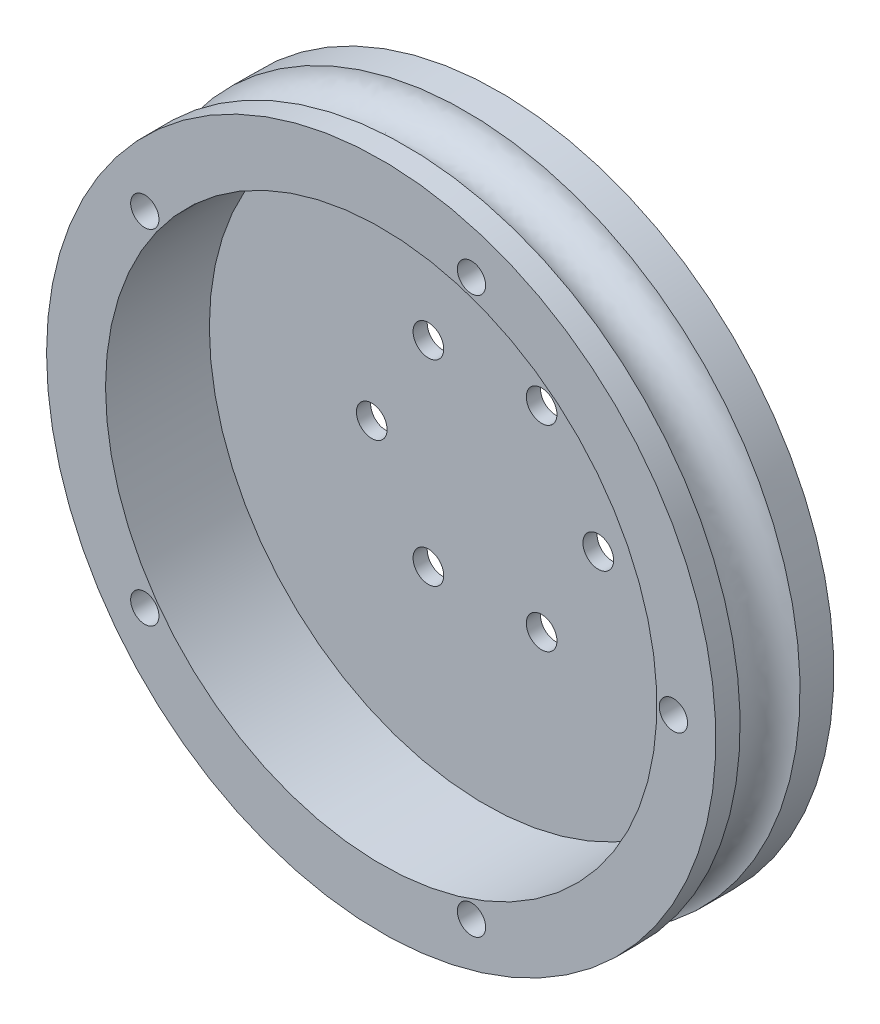
ISO-10303-21;
HEADER;
FILE_DESCRIPTION(('STEP AP214'),'2;1');
FILE_NAME('part.step','',(''),(''),'','','');
FILE_SCHEMA(('AUTOMOTIVE_DESIGN { 1 0 10303 214 1 1 1 1 }'));
ENDSEC;
DATA;
#1=APPLICATION_CONTEXT('core data for automotive mechanical design processes');
#2=APPLICATION_PROTOCOL_DEFINITION('international standard','automotive_design',2000,#1);
#3=PRODUCT_CONTEXT('',#1,'mechanical');
#4=PRODUCT('Part','Part','',(#3));
#5=PRODUCT_RELATED_PRODUCT_CATEGORY('part','',(#4));
#6=PRODUCT_DEFINITION_FORMATION('','',#4);
#7=PRODUCT_DEFINITION_CONTEXT('part definition',#1,'design');
#8=PRODUCT_DEFINITION('design','',#6,#7);
#9=PRODUCT_DEFINITION_SHAPE('','',#8);
#10=(LENGTH_UNIT() NAMED_UNIT(*) SI_UNIT(.MILLI.,.METRE.));
#11=(NAMED_UNIT(*) PLANE_ANGLE_UNIT() SI_UNIT($,.RADIAN.));
#12=(NAMED_UNIT(*) SI_UNIT($,.STERADIAN.) SOLID_ANGLE_UNIT());
#13=UNCERTAINTY_MEASURE_WITH_UNIT(LENGTH_MEASURE(1.E-05),#10,'distance_accuracy_value','');
#14=(GEOMETRIC_REPRESENTATION_CONTEXT(3) GLOBAL_UNCERTAINTY_ASSIGNED_CONTEXT((#13)) GLOBAL_UNIT_ASSIGNED_CONTEXT((#10,
#11,#12)) REPRESENTATION_CONTEXT('',''));
#15=CARTESIAN_POINT('',(0.,0.,0.));
#16=DIRECTION('',(0.,0.,1.));
#17=DIRECTION('',(1.,0.,0.));
#18=AXIS2_PLACEMENT_3D('',#15,#16,#17);
#19=CARTESIAN_POINT('',(11.2096637499569,57.3172158216385,74.6018381281178));
#20=DIRECTION('',(0.,0.,-1.));
#21=DIRECTION('',(-1.,0.,0.));
#22=AXIS2_PLACEMENT_3D('',#19,#20,#21);
#23=CYLINDRICAL_SURFACE('',#22,35.4663369894019);
#24=CARTESIAN_POINT('',(11.2096637499569,57.3172158216385,72.0273615546319));
#25=DIRECTION('',(0.,0.,-1.));
#26=DIRECTION('',(-1.,0.,0.));
#27=AXIS2_PLACEMENT_3D('',#24,#25,#26);
#28=CIRCLE('',#27,35.4663369894019);
#29=CARTESIAN_POINT('',(0.,90.965462403871,72.0273615546319));
#30=VERTEX_POINT('',#29);
#31=EDGE_CURVE('E14',#30,#30,#28,.T.);
#32=ORIENTED_EDGE('',*,*,#31,.F.);
#33=EDGE_LOOP('',(#32));
#34=FACE_BOUND('',#33,.T.);
#35=CARTESIAN_POINT('',(11.2096637499569,57.3172158216385,74.6018381281178));
#36=DIRECTION('',(0.,0.,-1.));
#37=DIRECTION('',(-1.,0.,0.));
#38=AXIS2_PLACEMENT_3D('',#35,#36,#37);
#39=CIRCLE('',#38,35.4663369894019);
#40=CARTESIAN_POINT('',(-24.256673239445,57.3172158216385,74.6018381281178));
#41=VERTEX_POINT('',#40);
#42=EDGE_CURVE('E141',#41,#41,#39,.T.);
#43=ORIENTED_EDGE('',*,*,#42,.T.);
#44=EDGE_LOOP('',(#43));
#45=FACE_BOUND('',#44,.T.);
#46=ADVANCED_FACE('F48',(#34,#45),#23,.T.);
#47=CARTESIAN_POINT('',(11.2096637499569,57.3172158216385,65.6763147016038));
#48=DIRECTION('',(0.,0.,-1.));
#49=DIRECTION('',(-1.,0.,0.));
#50=AXIS2_PLACEMENT_3D('',#47,#48,#49);
#51=CIRCLE('',#50,35.4663369894019);
#52=CARTESIAN_POINT('',(0.,90.965462403871,65.6763147016038));
#53=VERTEX_POINT('',#52);
#54=EDGE_CURVE('E56',#53,#53,#51,.F.);
#55=ORIENTED_EDGE('',*,*,#54,.F.);
#56=EDGE_LOOP('',(#55));
#57=FACE_BOUND('',#56,.T.);
#58=CARTESIAN_POINT('',(11.2096637499569,57.3172158216385,62.1018381281178));
#59=DIRECTION('',(0.,0.,-1.));
#60=DIRECTION('',(-1.,0.,0.));
#61=AXIS2_PLACEMENT_3D('',#58,#59,#60);
#62=CIRCLE('',#61,35.4663369894019);
#63=CARTESIAN_POINT('',(-24.256673239445,57.3172158216385,62.1018381281178));
#64=VERTEX_POINT('',#63);
#65=EDGE_CURVE('E140',#64,#64,#62,.T.);
#66=ORIENTED_EDGE('',*,*,#65,.F.);
#67=EDGE_LOOP('',(#66));
#68=FACE_BOUND('',#67,.T.);
#69=ADVANCED_FACE('F50',(#57,#68),#23,.T.);
#70=CARTESIAN_POINT('',(11.2096637499569,57.3172158216385,74.6018381281178));
#71=DIRECTION('',(0.,0.,-1.));
#72=DIRECTION('',(-1.,0.,0.));
#73=AXIS2_PLACEMENT_3D('',#70,#71,#72);
#74=PLANE('',#73);
#75=CARTESIAN_POINT('',(-13.8426291280109,75.5187720215277,74.6018381281178));
#76=DIRECTION('',(0.,0.,-1.));
#77=DIRECTION('',(0.809016994374951,-0.587785252292469,0.));
#78=AXIS2_PLACEMENT_3D('',#75,#76,#77);
#79=CIRCLE('',#78,1.5);
#80=CARTESIAN_POINT('',(-12.6291036364485,74.637094143089,74.6018381281178));
#81=VERTEX_POINT('',#80);
#82=EDGE_CURVE('E105',#81,#81,#79,.T.);
#83=ORIENTED_EDGE('',*,*,#82,.T.);
#84=EDGE_LOOP('',(#83));
#85=FACE_BOUND('',#84,.T.);
#86=CARTESIAN_POINT('',(-13.8426291280106,39.115659621749,74.6018381281178));
#87=DIRECTION('',(0.,0.,-1.));
#88=DIRECTION('',(0.809016994374942,0.58778525229248,0.));
#89=AXIS2_PLACEMENT_3D('',#86,#87,#88);
#90=CIRCLE('',#89,1.5);
#91=CARTESIAN_POINT('',(-12.6291036364482,39.9973375001877,74.6018381281178));
#92=VERTEX_POINT('',#91);
#93=EDGE_CURVE('E112',#92,#92,#90,.T.);
#94=ORIENTED_EDGE('',*,*,#93,.T.);
#95=EDGE_LOOP('',(#94));
#96=FACE_BOUND('',#95,.T.);
#97=CARTESIAN_POINT('',(20.778788133224,27.8664792420763,74.6018381281178));
#98=DIRECTION('',(0.,0.,-1.));
#99=DIRECTION('',(-0.309016994374958,0.95105651629515,0.));
#100=AXIS2_PLACEMENT_3D('',#97,#98,#99);
#101=CIRCLE('',#100,1.5);
#102=CARTESIAN_POINT('',(20.3152626416615,29.293064016519,74.6018381281178));
#103=VERTEX_POINT('',#102);
#104=EDGE_CURVE('E118',#103,#103,#101,.T.);
#105=ORIENTED_EDGE('',*,*,#104,.T.);
#106=EDGE_LOOP('',(#105));
#107=FACE_BOUND('',#106,.T.);
#108=CARTESIAN_POINT('',(20.7787881332235,86.7679524012009,74.6018381281178));
#109=DIRECTION('',(0.,0.,-1.));
#110=DIRECTION('',(-0.309016994374945,-0.951056516295155,0.));
#111=AXIS2_PLACEMENT_3D('',#108,#109,#110);
#112=CIRCLE('',#111,1.5);
#113=CARTESIAN_POINT('',(20.3152626416611,85.3413676267581,74.6018381281178));
#114=VERTEX_POINT('',#113);
#115=EDGE_CURVE('E123',#114,#114,#112,.T.);
#116=ORIENTED_EDGE('',*,*,#115,.T.);
#117=EDGE_LOOP('',(#116));
#118=FACE_BOUND('',#117,.T.);
#119=CARTESIAN_POINT('',(42.1760007393588,57.3172158216385,74.6018381281178));
#120=DIRECTION('',(0.,0.,-1.));
#121=DIRECTION('',(-1.,0.,0.));
#122=AXIS2_PLACEMENT_3D('',#119,#120,#121);
#123=CIRCLE('',#122,1.5);
#124=CARTESIAN_POINT('',(40.6760007393588,57.3172158216385,74.6018381281178));
#125=VERTEX_POINT('',#124);
#126=EDGE_CURVE('E129',#125,#125,#123,.T.);
#127=ORIENTED_EDGE('',*,*,#126,.T.);
#128=EDGE_LOOP('',(#127));
#129=FACE_BOUND('',#128,.T.);
#130=CARTESIAN_POINT('',(11.2096637499569,57.3172158216385,74.6018381281178));
#131=DIRECTION('',(0.,0.,-1.));
#132=DIRECTION('',(-1.,0.,0.));
#133=AXIS2_PLACEMENT_3D('',#130,#131,#132);
#134=CIRCLE('',#133,29.2163369894019);
#135=CARTESIAN_POINT('',(-18.006673239445,57.3172158216385,74.6018381281178));
#136=VERTEX_POINT('',#135);
#137=EDGE_CURVE('E132',#136,#136,#134,.T.);
#138=ORIENTED_EDGE('',*,*,#137,.T.);
#139=EDGE_LOOP('',(#138));
#140=FACE_BOUND('',#139,.T.);
#141=ORIENTED_EDGE('',*,*,#42,.F.);
#142=EDGE_LOOP('',(#141));
#143=FACE_BOUND('',#142,.T.);
#144=ADVANCED_FACE('F150',(#85,#96,#107,#118,#129,#140,#143),#74,.F.);
#145=CARTESIAN_POINT('',(11.2096637499569,57.3172158216385,62.1018381281178));
#146=DIRECTION('',(0.,0.,-1.));
#147=DIRECTION('',(-1.,0.,0.));
#148=AXIS2_PLACEMENT_3D('',#145,#146,#147);
#149=PLANE('',#148);
#150=CARTESIAN_POINT('',(17.2096637499569,46.9249109762253,62.1018381281178));
#151=DIRECTION('',(0.,0.,1.));
#152=DIRECTION('',(-0.500000000000004,0.866025403784436,0.));
#153=AXIS2_PLACEMENT_3D('',#150,#151,#152);
#154=CIRCLE('',#153,1.625);
#155=CARTESIAN_POINT('',(16.3971637499569,48.332202257375,62.1018381281178));
#156=VERTEX_POINT('',#155);
#157=EDGE_CURVE('E72',#156,#156,#154,.T.);
#158=ORIENTED_EDGE('',*,*,#157,.T.);
#159=EDGE_LOOP('',(#158));
#160=FACE_BOUND('',#159,.T.);
#161=CARTESIAN_POINT('',(23.2096637499569,57.3172158216385,62.1018381281178));
#162=DIRECTION('',(0.,0.,1.));
#163=DIRECTION('',(-1.,0.,0.));
#164=AXIS2_PLACEMENT_3D('',#161,#162,#163);
#165=CIRCLE('',#164,1.625);
#166=CARTESIAN_POINT('',(21.5846637499569,57.3172158216385,62.1018381281178));
#167=VERTEX_POINT('',#166);
#168=EDGE_CURVE('E79',#167,#167,#165,.T.);
#169=ORIENTED_EDGE('',*,*,#168,.T.);
#170=EDGE_LOOP('',(#169));
#171=FACE_BOUND('',#170,.T.);
#172=CARTESIAN_POINT('',(17.2096637499568,67.7095206670518,62.1018381281178));
#173=DIRECTION('',(0.,0.,1.));
#174=DIRECTION('',(-0.499999999999992,-0.866025403784443,0.));
#175=AXIS2_PLACEMENT_3D('',#172,#173,#174);
#176=CIRCLE('',#175,1.625);
#177=CARTESIAN_POINT('',(16.3971637499568,66.3022293859021,62.1018381281178));
#178=VERTEX_POINT('',#177);
#179=EDGE_CURVE('E85',#178,#178,#176,.T.);
#180=ORIENTED_EDGE('',*,*,#179,.T.);
#181=EDGE_LOOP('',(#180));
#182=FACE_BOUND('',#181,.T.);
#183=CARTESIAN_POINT('',(5.20966374995677,67.7095206670517,62.1018381281178));
#184=DIRECTION('',(0.,0.,1.));
#185=DIRECTION('',(0.50000000000001,-0.866025403784433,0.));
#186=AXIS2_PLACEMENT_3D('',#183,#184,#185);
#187=CIRCLE('',#186,1.625);
#188=CARTESIAN_POINT('',(6.02216374995678,66.302229385902,62.1018381281178));
#189=VERTEX_POINT('',#188);
#190=EDGE_CURVE('E69',#189,#189,#187,.T.);
#191=ORIENTED_EDGE('',*,*,#190,.T.);
#192=EDGE_LOOP('',(#191));
#193=FACE_BOUND('',#192,.T.);
#194=CARTESIAN_POINT('',(5.20966374995691,46.9249109762252,62.1018381281178));
#195=DIRECTION('',(0.,0.,1.));
#196=DIRECTION('',(0.499999999999998,0.86602540378444,0.));
#197=AXIS2_PLACEMENT_3D('',#194,#195,#196);
#198=CIRCLE('',#197,1.625);
#199=CARTESIAN_POINT('',(6.02216374995691,48.3322022573749,62.1018381281178));
#200=VERTEX_POINT('',#199);
#201=EDGE_CURVE('E93',#200,#200,#198,.T.);
#202=ORIENTED_EDGE('',*,*,#201,.T.);
#203=EDGE_LOOP('',(#202));
#204=FACE_BOUND('',#203,.T.);
#205=CARTESIAN_POINT('',(-0.790336250043112,57.3172158216385,62.1018381281178));
#206=DIRECTION('',(0.,0.,1.));
#207=DIRECTION('',(1.,0.,0.));
#208=AXIS2_PLACEMENT_3D('',#205,#206,#207);
#209=CIRCLE('',#208,1.625);
#210=CARTESIAN_POINT('',(0.834663749956889,57.3172158216385,62.1018381281178));
#211=VERTEX_POINT('',#210);
#212=EDGE_CURVE('E99',#211,#211,#209,.T.);
#213=ORIENTED_EDGE('',*,*,#212,.T.);
#214=EDGE_LOOP('',(#213));
#215=FACE_BOUND('',#214,.T.);
#216=CARTESIAN_POINT('',(-13.8426291280109,75.5187720215277,62.1018381281178));
#217=DIRECTION('',(0.,0.,-1.));
#218=DIRECTION('',(0.809016994374951,-0.587785252292469,0.));
#219=AXIS2_PLACEMENT_3D('',#216,#217,#218);
#220=CIRCLE('',#219,1.5);
#221=CARTESIAN_POINT('',(-12.6291036364485,74.637094143089,62.1018381281178));
#222=VERTEX_POINT('',#221);
#223=EDGE_CURVE('E109',#222,#222,#220,.T.);
#224=ORIENTED_EDGE('',*,*,#223,.F.);
#225=EDGE_LOOP('',(#224));
#226=FACE_BOUND('',#225,.T.);
#227=CARTESIAN_POINT('',(-13.8426291280106,39.115659621749,62.1018381281178));
#228=DIRECTION('',(0.,0.,-1.));
#229=DIRECTION('',(0.809016994374942,0.58778525229248,0.));
#230=AXIS2_PLACEMENT_3D('',#227,#228,#229);
#231=CIRCLE('',#230,1.5);
#232=CARTESIAN_POINT('',(-12.6291036364482,39.9973375001877,62.1018381281178));
#233=VERTEX_POINT('',#232);
#234=EDGE_CURVE('E115',#233,#233,#231,.T.);
#235=ORIENTED_EDGE('',*,*,#234,.F.);
#236=EDGE_LOOP('',(#235));
#237=FACE_BOUND('',#236,.T.);
#238=CARTESIAN_POINT('',(20.778788133224,27.8664792420763,62.1018381281178));
#239=DIRECTION('',(0.,0.,-1.));
#240=DIRECTION('',(-0.309016994374958,0.95105651629515,0.));
#241=AXIS2_PLACEMENT_3D('',#238,#239,#240);
#242=CIRCLE('',#241,1.5);
#243=CARTESIAN_POINT('',(20.3152626416615,29.293064016519,62.1018381281178));
#244=VERTEX_POINT('',#243);
#245=EDGE_CURVE('E102',#244,#244,#242,.T.);
#246=ORIENTED_EDGE('',*,*,#245,.F.);
#247=EDGE_LOOP('',(#246));
#248=FACE_BOUND('',#247,.T.);
#249=CARTESIAN_POINT('',(20.7787881332235,86.7679524012009,62.1018381281178));
#250=DIRECTION('',(0.,0.,-1.));
#251=DIRECTION('',(-0.309016994374945,-0.951056516295155,0.));
#252=AXIS2_PLACEMENT_3D('',#249,#250,#251);
#253=CIRCLE('',#252,1.5);
#254=CARTESIAN_POINT('',(20.3152626416611,85.3413676267581,62.1018381281178));
#255=VERTEX_POINT('',#254);
#256=EDGE_CURVE('E108',#255,#255,#253,.T.);
#257=ORIENTED_EDGE('',*,*,#256,.F.);
#258=EDGE_LOOP('',(#257));
#259=FACE_BOUND('',#258,.T.);
#260=CARTESIAN_POINT('',(42.1760007393588,57.3172158216385,62.1018381281178));
#261=DIRECTION('',(0.,0.,-1.));
#262=DIRECTION('',(-1.,0.,0.));
#263=AXIS2_PLACEMENT_3D('',#260,#261,#262);
#264=CIRCLE('',#263,1.5);
#265=CARTESIAN_POINT('',(40.6760007393588,57.3172158216385,62.1018381281178));
#266=VERTEX_POINT('',#265);
#267=EDGE_CURVE('E126',#266,#266,#264,.T.);
#268=ORIENTED_EDGE('',*,*,#267,.F.);
#269=EDGE_LOOP('',(#268));
#270=FACE_BOUND('',#269,.T.);
#271=ORIENTED_EDGE('',*,*,#65,.T.);
#272=EDGE_LOOP('',(#271));
#273=FACE_BOUND('',#272,.T.);
#274=ADVANCED_FACE('F147',(#160,#171,#182,#193,#204,#215,#226,#237,#248,#259,#270,#273),#149,.T.);
#275=CARTESIAN_POINT('',(11.2096637499569,57.3172158216385,-20.534441898432));
#276=DIRECTION('',(0.,0.,1.));
#277=DIRECTION('',(1.,0.,0.));
#278=AXIS2_PLACEMENT_3D('',#275,#276,#277);
#279=CYLINDRICAL_SURFACE('',#278,29.2163369894019);
#280=ORIENTED_EDGE('',*,*,#137,.F.);
#281=EDGE_LOOP('',(#280));
#282=FACE_BOUND('',#281,.T.);
#283=CARTESIAN_POINT('',(11.2096637499569,57.3172158216385,63.6018381281178));
#284=DIRECTION('',(0.,0.,-1.));
#285=DIRECTION('',(-1.,0.,0.));
#286=AXIS2_PLACEMENT_3D('',#283,#284,#285);
#287=CIRCLE('',#286,29.2163369894019);
#288=CARTESIAN_POINT('',(-18.006673239445,57.3172158216385,63.6018381281178));
#289=VERTEX_POINT('',#288);
#290=EDGE_CURVE('E137',#289,#289,#287,.T.);
#291=ORIENTED_EDGE('',*,*,#290,.T.);
#292=EDGE_LOOP('',(#291));
#293=FACE_BOUND('',#292,.T.);
#294=ADVANCED_FACE('F277',(#282,#293),#279,.F.);
#295=CARTESIAN_POINT('',(11.2096637499569,57.3172158216385,63.6018381281178));
#296=DIRECTION('',(0.,0.,-1.));
#297=DIRECTION('',(-1.,0.,0.));
#298=AXIS2_PLACEMENT_3D('',#295,#296,#297);
#299=PLANE('',#298);
#300=CARTESIAN_POINT('',(17.2096637499569,46.9249109762253,63.6018381281178));
#301=DIRECTION('',(0.,0.,1.));
#302=DIRECTION('',(-0.500000000000004,0.866025403784436,0.));
#303=AXIS2_PLACEMENT_3D('',#300,#301,#302);
#304=CIRCLE('',#303,1.625);
#305=CARTESIAN_POINT('',(16.3971637499569,48.332202257375,63.6018381281178));
#306=VERTEX_POINT('',#305);
#307=EDGE_CURVE('E76',#306,#306,#304,.T.);
#308=ORIENTED_EDGE('',*,*,#307,.F.);
#309=EDGE_LOOP('',(#308));
#310=FACE_BOUND('',#309,.T.);
#311=CARTESIAN_POINT('',(23.2096637499569,57.3172158216385,63.6018381281178));
#312=DIRECTION('',(0.,0.,1.));
#313=DIRECTION('',(-1.,0.,0.));
#314=AXIS2_PLACEMENT_3D('',#311,#312,#313);
#315=CIRCLE('',#314,1.625);
#316=CARTESIAN_POINT('',(21.5846637499569,57.3172158216385,63.6018381281178));
#317=VERTEX_POINT('',#316);
#318=EDGE_CURVE('E82',#317,#317,#315,.T.);
#319=ORIENTED_EDGE('',*,*,#318,.F.);
#320=EDGE_LOOP('',(#319));
#321=FACE_BOUND('',#320,.T.);
#322=CARTESIAN_POINT('',(17.2096637499568,67.7095206670518,63.6018381281178));
#323=DIRECTION('',(0.,0.,1.));
#324=DIRECTION('',(-0.499999999999992,-0.866025403784443,0.));
#325=AXIS2_PLACEMENT_3D('',#322,#323,#324);
#326=CIRCLE('',#325,1.625);
#327=CARTESIAN_POINT('',(16.3971637499568,66.3022293859021,63.6018381281178));
#328=VERTEX_POINT('',#327);
#329=EDGE_CURVE('E88',#328,#328,#326,.T.);
#330=ORIENTED_EDGE('',*,*,#329,.F.);
#331=EDGE_LOOP('',(#330));
#332=FACE_BOUND('',#331,.T.);
#333=CARTESIAN_POINT('',(5.20966374995677,67.7095206670517,63.6018381281178));
#334=DIRECTION('',(0.,0.,1.));
#335=DIRECTION('',(0.50000000000001,-0.866025403784433,0.));
#336=AXIS2_PLACEMENT_3D('',#333,#334,#335);
#337=CIRCLE('',#336,1.625);
#338=CARTESIAN_POINT('',(6.02216374995678,66.302229385902,63.6018381281178));
#339=VERTEX_POINT('',#338);
#340=EDGE_CURVE('E66',#339,#339,#337,.T.);
#341=ORIENTED_EDGE('',*,*,#340,.F.);
#342=EDGE_LOOP('',(#341));
#343=FACE_BOUND('',#342,.T.);
#344=CARTESIAN_POINT('',(5.20966374995691,46.9249109762252,63.6018381281178));
#345=DIRECTION('',(0.,0.,1.));
#346=DIRECTION('',(0.499999999999998,0.86602540378444,0.));
#347=AXIS2_PLACEMENT_3D('',#344,#345,#346);
#348=CIRCLE('',#347,1.625);
#349=CARTESIAN_POINT('',(6.02216374995691,48.3322022573749,63.6018381281178));
#350=VERTEX_POINT('',#349);
#351=EDGE_CURVE('E75',#350,#350,#348,.T.);
#352=ORIENTED_EDGE('',*,*,#351,.F.);
#353=EDGE_LOOP('',(#352));
#354=FACE_BOUND('',#353,.T.);
#355=CARTESIAN_POINT('',(-0.790336250043112,57.3172158216385,63.6018381281178));
#356=DIRECTION('',(0.,0.,1.));
#357=DIRECTION('',(1.,0.,0.));
#358=AXIS2_PLACEMENT_3D('',#355,#356,#357);
#359=CIRCLE('',#358,1.625);
#360=CARTESIAN_POINT('',(0.834663749956889,57.3172158216385,63.6018381281178));
#361=VERTEX_POINT('',#360);
#362=EDGE_CURVE('E96',#361,#361,#359,.T.);
#363=ORIENTED_EDGE('',*,*,#362,.F.);
#364=EDGE_LOOP('',(#363));
#365=FACE_BOUND('',#364,.T.);
#366=ORIENTED_EDGE('',*,*,#290,.F.);
#367=EDGE_LOOP('',(#366));
#368=FACE_BOUND('',#367,.T.);
#369=ADVANCED_FACE('F269',(#310,#321,#332,#343,#354,#365,#368),#299,.F.);
#370=CARTESIAN_POINT('',(42.1760007393588,57.3172158216385,74.6018381281178));
#371=DIRECTION('',(0.,0.,-1.));
#372=DIRECTION('',(-1.,0.,0.));
#373=AXIS2_PLACEMENT_3D('',#370,#371,#372);
#374=CYLINDRICAL_SURFACE('',#373,1.5);
#375=ORIENTED_EDGE('',*,*,#126,.F.);
#376=EDGE_LOOP('',(#375));
#377=FACE_BOUND('',#376,.T.);
#378=ORIENTED_EDGE('',*,*,#267,.T.);
#379=EDGE_LOOP('',(#378));
#380=FACE_BOUND('',#379,.T.);
#381=ADVANCED_FACE('F260',(#377,#380),#374,.F.);
#382=CARTESIAN_POINT('',(20.7787881332235,86.7679524012009,74.6018381281178));
#383=DIRECTION('',(0.,0.,-1.));
#384=DIRECTION('',(-1.,0.,0.));
#385=AXIS2_PLACEMENT_3D('',#382,#383,#384);
#386=CYLINDRICAL_SURFACE('',#385,1.5);
#387=ORIENTED_EDGE('',*,*,#115,.F.);
#388=EDGE_LOOP('',(#387));
#389=FACE_BOUND('',#388,.T.);
#390=ORIENTED_EDGE('',*,*,#256,.T.);
#391=EDGE_LOOP('',(#390));
#392=FACE_BOUND('',#391,.T.);
#393=ADVANCED_FACE('F252',(#389,#392),#386,.F.);
#394=CARTESIAN_POINT('',(20.778788133224,27.8664792420763,74.6018381281178));
#395=DIRECTION('',(0.,0.,-1.));
#396=DIRECTION('',(-1.,0.,0.));
#397=AXIS2_PLACEMENT_3D('',#394,#395,#396);
#398=CYLINDRICAL_SURFACE('',#397,1.5);
#399=ORIENTED_EDGE('',*,*,#104,.F.);
#400=EDGE_LOOP('',(#399));
#401=FACE_BOUND('',#400,.T.);
#402=ORIENTED_EDGE('',*,*,#245,.T.);
#403=EDGE_LOOP('',(#402));
#404=FACE_BOUND('',#403,.T.);
#405=ADVANCED_FACE('F244',(#401,#404),#398,.F.);
#406=CARTESIAN_POINT('',(-13.8426291280106,39.115659621749,74.6018381281178));
#407=DIRECTION('',(0.,0.,-1.));
#408=DIRECTION('',(-1.,0.,0.));
#409=AXIS2_PLACEMENT_3D('',#406,#407,#408);
#410=CYLINDRICAL_SURFACE('',#409,1.5);
#411=ORIENTED_EDGE('',*,*,#93,.F.);
#412=EDGE_LOOP('',(#411));
#413=FACE_BOUND('',#412,.T.);
#414=ORIENTED_EDGE('',*,*,#234,.T.);
#415=EDGE_LOOP('',(#414));
#416=FACE_BOUND('',#415,.T.);
#417=ADVANCED_FACE('F236',(#413,#416),#410,.F.);
#418=CARTESIAN_POINT('',(-13.8426291280109,75.5187720215277,74.6018381281178));
#419=DIRECTION('',(0.,0.,-1.));
#420=DIRECTION('',(-1.,0.,0.));
#421=AXIS2_PLACEMENT_3D('',#418,#419,#420);
#422=CYLINDRICAL_SURFACE('',#421,1.5);
#423=ORIENTED_EDGE('',*,*,#82,.F.);
#424=EDGE_LOOP('',(#423));
#425=FACE_BOUND('',#424,.T.);
#426=ORIENTED_EDGE('',*,*,#223,.T.);
#427=EDGE_LOOP('',(#426));
#428=FACE_BOUND('',#427,.T.);
#429=ADVANCED_FACE('F227',(#425,#428),#422,.F.);
#430=CARTESIAN_POINT('',(-0.790336250043112,57.3172158216385,62.1018381281178));
#431=DIRECTION('',(0.,0.,1.));
#432=DIRECTION('',(1.,0.,0.));
#433=AXIS2_PLACEMENT_3D('',#430,#431,#432);
#434=CYLINDRICAL_SURFACE('',#433,1.625);
#435=ORIENTED_EDGE('',*,*,#212,.F.);
#436=EDGE_LOOP('',(#435));
#437=FACE_BOUND('',#436,.T.);
#438=ORIENTED_EDGE('',*,*,#362,.T.);
#439=EDGE_LOOP('',(#438));
#440=FACE_BOUND('',#439,.T.);
#441=ADVANCED_FACE('F218',(#437,#440),#434,.F.);
#442=CARTESIAN_POINT('',(5.20966374995691,46.9249109762252,62.1018381281178));
#443=DIRECTION('',(0.,0.,1.));
#444=DIRECTION('',(1.,0.,0.));
#445=AXIS2_PLACEMENT_3D('',#442,#443,#444);
#446=CYLINDRICAL_SURFACE('',#445,1.625);
#447=ORIENTED_EDGE('',*,*,#201,.F.);
#448=EDGE_LOOP('',(#447));
#449=FACE_BOUND('',#448,.T.);
#450=ORIENTED_EDGE('',*,*,#351,.T.);
#451=EDGE_LOOP('',(#450));
#452=FACE_BOUND('',#451,.T.);
#453=ADVANCED_FACE('F210',(#449,#452),#446,.F.);
#454=CARTESIAN_POINT('',(5.20966374995677,67.7095206670517,62.1018381281178));
#455=DIRECTION('',(0.,0.,1.));
#456=DIRECTION('',(1.,0.,0.));
#457=AXIS2_PLACEMENT_3D('',#454,#455,#456);
#458=CYLINDRICAL_SURFACE('',#457,1.625);
#459=ORIENTED_EDGE('',*,*,#190,.F.);
#460=EDGE_LOOP('',(#459));
#461=FACE_BOUND('',#460,.T.);
#462=ORIENTED_EDGE('',*,*,#340,.T.);
#463=EDGE_LOOP('',(#462));
#464=FACE_BOUND('',#463,.T.);
#465=ADVANCED_FACE('F202',(#461,#464),#458,.F.);
#466=CARTESIAN_POINT('',(17.2096637499568,67.7095206670518,62.1018381281178));
#467=DIRECTION('',(0.,0.,1.));
#468=DIRECTION('',(1.,0.,0.));
#469=AXIS2_PLACEMENT_3D('',#466,#467,#468);
#470=CYLINDRICAL_SURFACE('',#469,1.625);
#471=ORIENTED_EDGE('',*,*,#179,.F.);
#472=EDGE_LOOP('',(#471));
#473=FACE_BOUND('',#472,.T.);
#474=ORIENTED_EDGE('',*,*,#329,.T.);
#475=EDGE_LOOP('',(#474));
#476=FACE_BOUND('',#475,.T.);
#477=ADVANCED_FACE('F194',(#473,#476),#470,.F.);
#478=CARTESIAN_POINT('',(23.2096637499569,57.3172158216385,62.1018381281178));
#479=DIRECTION('',(0.,0.,1.));
#480=DIRECTION('',(1.,0.,0.));
#481=AXIS2_PLACEMENT_3D('',#478,#479,#480);
#482=CYLINDRICAL_SURFACE('',#481,1.625);
#483=ORIENTED_EDGE('',*,*,#168,.F.);
#484=EDGE_LOOP('',(#483));
#485=FACE_BOUND('',#484,.T.);
#486=ORIENTED_EDGE('',*,*,#318,.T.);
#487=EDGE_LOOP('',(#486));
#488=FACE_BOUND('',#487,.T.);
#489=ADVANCED_FACE('F189',(#485,#488),#482,.F.);
#490=CARTESIAN_POINT('',(17.2096637499569,46.9249109762253,62.1018381281178));
#491=DIRECTION('',(0.,0.,1.));
#492=DIRECTION('',(1.,0.,0.));
#493=AXIS2_PLACEMENT_3D('',#490,#491,#492);
#494=CYLINDRICAL_SURFACE('',#493,1.625);
#495=ORIENTED_EDGE('',*,*,#157,.F.);
#496=EDGE_LOOP('',(#495));
#497=FACE_BOUND('',#496,.T.);
#498=ORIENTED_EDGE('',*,*,#307,.T.);
#499=EDGE_LOOP('',(#498));
#500=FACE_BOUND('',#499,.T.);
#501=ADVANCED_FACE('F171',(#497,#500),#494,.F.);
#502=CARTESIAN_POINT('',(0.,91.36049527296,65.6518381281178));
#503=CARTESIAN_POINT('',(68.0865589026431,113.779822772874,65.6518381281178));
#504=CARTESIAN_POINT('',(90.5058864025569,45.6932638702307,65.6518381281178));
#505=CARTESIAN_POINT('',(22.4193274999138,23.273936370317,65.6518381281178));
#506=CARTESIAN_POINT('',(-45.6672314027293,0.854608870403187,65.6518381281178));
#507=CARTESIAN_POINT('',(-68.0865589026431,68.9411677730463,65.6518381281178));
#508=CARTESIAN_POINT('',(0.,91.36049527296,65.6518381281178));
#509=CARTESIAN_POINT('',(0.,97.7604952729601,65.6518381281178));
#510=CARTESIAN_POINT('',(80.8865589026431,120.179822772874,65.6518381281178));
#511=CARTESIAN_POINT('',(103.305886402557,39.2932638702307,65.6518381281178));
#512=CARTESIAN_POINT('',(22.4193274999138,16.8739363703169,65.6518381281178));
#513=CARTESIAN_POINT('',(-58.4672314027294,-5.54539112959684,65.6518381281178));
#514=CARTESIAN_POINT('',(-80.8865589026431,75.3411677730463,65.6518381281178));
#515=CARTESIAN_POINT('',(0.,97.7604952729601,65.6518381281178));
#516=CARTESIAN_POINT('',(0.,97.7604952729601,72.0518381281179));
#517=CARTESIAN_POINT('',(80.8865589026431,120.179822772874,72.0518381281179));
#518=CARTESIAN_POINT('',(103.305886402557,39.2932638702307,72.0518381281179));
#519=CARTESIAN_POINT('',(22.4193274999138,16.8739363703169,72.0518381281179));
#520=CARTESIAN_POINT('',(-58.4672314027294,-5.54539112959684,72.0518381281179));
#521=CARTESIAN_POINT('',(-80.8865589026431,75.3411677730463,72.0518381281179));
#522=CARTESIAN_POINT('',(0.,97.7604952729601,72.0518381281179));
#523=CARTESIAN_POINT('',(0.,91.36049527296,72.0518381281179));
#524=CARTESIAN_POINT('',(68.0865589026431,113.779822772874,72.0518381281179));
#525=CARTESIAN_POINT('',(90.5058864025569,45.6932638702307,72.0518381281179));
#526=CARTESIAN_POINT('',(22.4193274999138,23.273936370317,72.0518381281179));
#527=CARTESIAN_POINT('',(-45.6672314027293,0.854608870403187,72.0518381281179));
#528=CARTESIAN_POINT('',(-68.0865589026431,68.9411677730463,72.0518381281179));
#529=CARTESIAN_POINT('',(0.,91.36049527296,72.0518381281179));
#530=CARTESIAN_POINT('',(0.,84.96049527296,72.0518381281179));
#531=CARTESIAN_POINT('',(55.286558902643,107.379822772874,72.0518381281179));
#532=CARTESIAN_POINT('',(77.7058864025568,52.0932638702308,72.0518381281179));
#533=CARTESIAN_POINT('',(22.4193274999138,29.673936370317,72.0518381281179));
#534=CARTESIAN_POINT('',(-32.8672314027292,7.25460887040322,72.0518381281179));
#535=CARTESIAN_POINT('',(-55.286558902643,62.5411677730462,72.0518381281179));
#536=CARTESIAN_POINT('',(0.,84.96049527296,72.0518381281179));
#537=CARTESIAN_POINT('',(0.,84.96049527296,65.6518381281178));
#538=CARTESIAN_POINT('',(55.286558902643,107.379822772874,65.6518381281178));
#539=CARTESIAN_POINT('',(77.7058864025568,52.0932638702308,65.6518381281178));
#540=CARTESIAN_POINT('',(22.4193274999138,29.673936370317,65.6518381281178));
#541=CARTESIAN_POINT('',(-32.8672314027292,7.25460887040322,65.6518381281178));
#542=CARTESIAN_POINT('',(-55.286558902643,62.5411677730462,65.6518381281178));
#543=CARTESIAN_POINT('',(0.,84.96049527296,65.6518381281178));
#544=CARTESIAN_POINT('',(0.,91.36049527296,65.6518381281178));
#545=CARTESIAN_POINT('',(68.0865589026431,113.779822772874,65.6518381281178));
#546=CARTESIAN_POINT('',(90.5058864025569,45.6932638702307,65.6518381281178));
#547=CARTESIAN_POINT('',(22.4193274999138,23.273936370317,65.6518381281178));
#548=CARTESIAN_POINT('',(-45.6672314027293,0.854608870403187,65.6518381281178));
#549=CARTESIAN_POINT('',(-68.0865589026431,68.9411677730463,65.6518381281178));
#550=CARTESIAN_POINT('',(0.,91.36049527296,65.6518381281178));
#551=(BOUNDED_SURFACE() B_SPLINE_SURFACE(3,3,((#502,#503,#504,#505,#506,#507,#508),(#509,#510,
#511,#512,#513,#514,#515),(#516,#517,#518,#519,#520,#521,#522),(#523,#524,#525,#526,#527,#528,
#529),(#530,#531,#532,#533,#534,#535,#536),(#537,#538,#539,#540,#541,#542,#543),(#544,#545,#546,
#547,#548,#549,#550)),.UNSPECIFIED.,.T.,.T.,.F.) B_SPLINE_SURFACE_WITH_KNOTS((4,3,4),(4,3,4),
(0.,0.5,1.),(0.,0.5,1.),
.UNSPECIFIED.) GEOMETRIC_REPRESENTATION_ITEM() RATIONAL_B_SPLINE_SURFACE(((1.,0.333333333333333,
0.333333333333333,1.,0.333333333333333,0.333333333333333,1.),(0.333333333333333,
0.111111111111111,0.111111111111111,0.333333333333333,0.111111111111111,0.111111111111111,
0.333333333333333),(0.333333333333333,0.111111111111111,0.111111111111111,0.333333333333333,
0.111111111111111,0.111111111111111,0.333333333333333),(1.,0.333333333333333,0.333333333333333,
1.,0.333333333333333,0.333333333333333,1.),(0.333333333333333,0.111111111111111,
0.111111111111111,0.333333333333333,0.111111111111111,0.111111111111111,0.333333333333333),
(0.333333333333333,0.111111111111111,0.111111111111111,0.333333333333333,0.111111111111111,
0.111111111111111,0.333333333333333),(1.,0.333333333333333,0.333333333333333,1.,
0.333333333333333,0.333333333333333,1.))) REPRESENTATION_ITEM('') SURFACE());
#552=CARTESIAN_POINT('',(0.,91.36049527296,68.8518381281178));
#553=DIRECTION('',(1.,0.,0.));
#554=DIRECTION('',(0.,0.,-1.));
#555=AXIS2_PLACEMENT_3D('',#552,#553,#554);
#556=CIRCLE('',#555,3.20000000000001);
#557=EDGE_CURVE('E62',#30,#53,#556,.T.);
#558=ORIENTED_EDGE('',*,*,#31,.T.);
#559=ORIENTED_EDGE('',*,*,#557,.T.);
#560=ORIENTED_EDGE('',*,*,#54,.T.);
#561=ORIENTED_EDGE('',*,*,#557,.F.);
#562=EDGE_LOOP('',(#558,#559,#560,#561));
#563=FACE_BOUND('',#562,.T.);
#564=ADVANCED_FACE('F63',(#563),#551,.F.);
#565=CLOSED_SHELL('',(#46,#69,#144,#274,#294,#369,#381,#393,#405,#417,#429,#441,#453,#465,#477,
#489,#501,#564));
#566=MANIFOLD_SOLID_BREP('B2',#565);
#567=ADVANCED_BREP_SHAPE_REPRESENTATION('',(#18,#566),#14);
#568=SHAPE_DEFINITION_REPRESENTATION(#9,#567);
ENDSEC;
END-ISO-10303-21;
